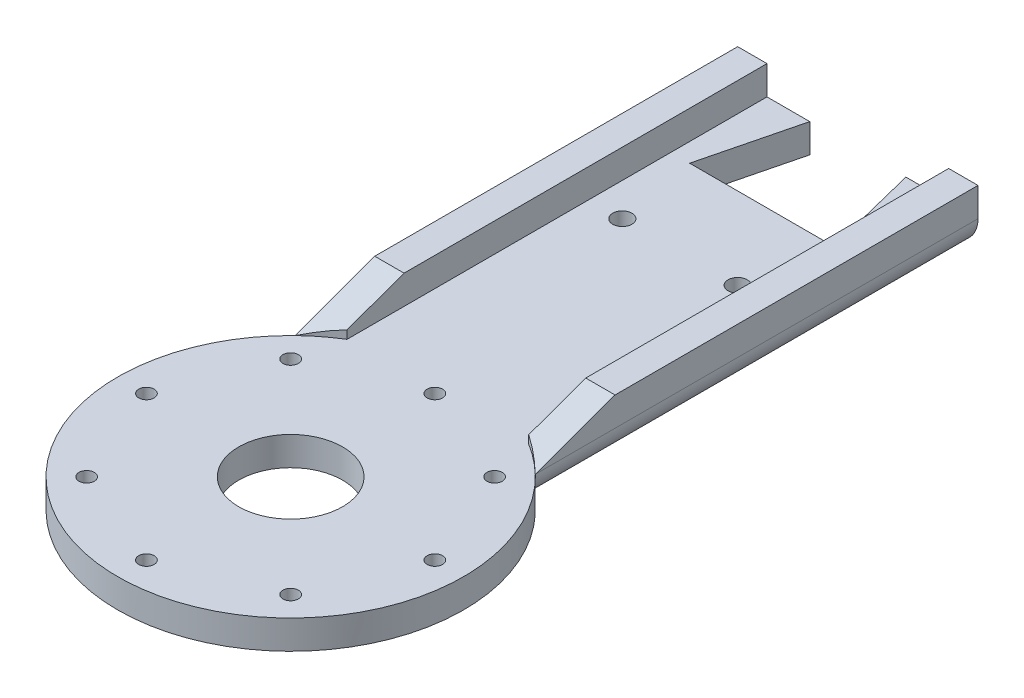
ISO-10303-21;
HEADER;
FILE_DESCRIPTION(('STEP AP214'),'2;1');
FILE_NAME('part.step','',(''),(''),'','','');
FILE_SCHEMA(('AUTOMOTIVE_DESIGN { 1 0 10303 214 1 1 1 1 }'));
ENDSEC;
DATA;
#1=APPLICATION_CONTEXT('core data for automotive mechanical design processes');
#2=APPLICATION_PROTOCOL_DEFINITION('international standard','automotive_design',2000,#1);
#3=PRODUCT_CONTEXT('',#1,'mechanical');
#4=PRODUCT('Part','Part','',(#3));
#5=PRODUCT_RELATED_PRODUCT_CATEGORY('part','',(#4));
#6=PRODUCT_DEFINITION_FORMATION('','',#4);
#7=PRODUCT_DEFINITION_CONTEXT('part definition',#1,'design');
#8=PRODUCT_DEFINITION('design','',#6,#7);
#9=PRODUCT_DEFINITION_SHAPE('','',#8);
#10=(LENGTH_UNIT() NAMED_UNIT(*) SI_UNIT(.MILLI.,.METRE.));
#11=(NAMED_UNIT(*) PLANE_ANGLE_UNIT() SI_UNIT($,.RADIAN.));
#12=(NAMED_UNIT(*) SI_UNIT($,.STERADIAN.) SOLID_ANGLE_UNIT());
#13=UNCERTAINTY_MEASURE_WITH_UNIT(LENGTH_MEASURE(1.E-05),#10,'distance_accuracy_value','');
#14=(GEOMETRIC_REPRESENTATION_CONTEXT(3) GLOBAL_UNCERTAINTY_ASSIGNED_CONTEXT((#13)) GLOBAL_UNIT_ASSIGNED_CONTEXT((#10,
#11,#12)) REPRESENTATION_CONTEXT('',''));
#15=CARTESIAN_POINT('',(0.,0.,0.));
#16=DIRECTION('',(0.,0.,1.));
#17=DIRECTION('',(1.,0.,0.));
#18=AXIS2_PLACEMENT_3D('',#15,#16,#17);
#19=CARTESIAN_POINT('',(0.226911438610488,3.,20.1632131954188));
#20=DIRECTION('',(0.,1.,0.));
#21=DIRECTION('',(0.,0.,1.));
#22=AXIS2_PLACEMENT_3D('',#19,#20,#21);
#23=PLANE('',#22);
#24=CARTESIAN_POINT('',(0.226911123610835,3.,20.1596174357801));
#25=DIRECTION('',(0.,-1.,0.));
#26=DIRECTION('',(0.,0.,1.));
#27=AXIS2_PLACEMENT_3D('',#24,#25,#26);
#28=CIRCLE('',#27,17.993847882213);
#29=CARTESIAN_POINT('',(-12.2730885613881,3.,7.21633464186544));
#30=VERTEX_POINT('',#29);
#31=CARTESIAN_POINT('',(-9.22308856138809,3.,4.84700604641411));
#32=VERTEX_POINT('',#31);
#33=EDGE_CURVE('E187',#30,#32,#28,.T.);
#34=ORIENTED_EDGE('',*,*,#33,.F.);
#35=CARTESIAN_POINT('',(0.226911438610488,3.,20.1632131954188));
#36=DIRECTION('',(0.,1.,0.));
#37=DIRECTION('',(0.,0.,1.));
#38=AXIS2_PLACEMENT_3D('',#35,#36,#37);
#39=CIRCLE('',#38,17.9964347658203);
#40=CARTESIAN_POINT('',(12.7269108086098,3.,7.21633464186544));
#41=VERTEX_POINT('',#40);
#42=EDGE_CURVE('E293',#30,#41,#39,.T.);
#43=ORIENTED_EDGE('',*,*,#42,.T.);
#44=CARTESIAN_POINT('',(0.226911123610835,3.,20.1596174357801));
#45=DIRECTION('',(0.,-1.,0.));
#46=DIRECTION('',(0.,0.,1.));
#47=AXIS2_PLACEMENT_3D('',#44,#45,#46);
#48=CIRCLE('',#47,17.993847882213);
#49=CARTESIAN_POINT('',(9.67691080860975,3.,4.8470060464141));
#50=VERTEX_POINT('',#49);
#51=EDGE_CURVE('E442',#50,#41,#48,.T.);
#52=ORIENTED_EDGE('',*,*,#51,.F.);
#53=DIRECTION('',(0.,0.,1.));
#54=VECTOR('',#53,1.);
#55=CARTESIAN_POINT('',(9.67691080860975,3.,-38.8403822770759));
#56=LINE('',#55,#54);
#57=CARTESIAN_POINT('',(9.67691080860975,3.,-38.8403822770759));
#58=VERTEX_POINT('',#57);
#59=EDGE_CURVE('E452',#58,#50,#56,.T.);
#60=ORIENTED_EDGE('',*,*,#59,.F.);
#61=DIRECTION('',(-1.,0.,0.));
#62=VECTOR('',#61,1.);
#63=CARTESIAN_POINT('',(5.22691143861272,3.,-38.8403822770759));
#64=LINE('',#63,#62);
#65=CARTESIAN_POINT('',(5.22691143861272,3.,-38.8403822770759));
#66=VERTEX_POINT('',#65);
#67=EDGE_CURVE('E297',#58,#66,#64,.T.);
#68=ORIENTED_EDGE('',*,*,#67,.T.);
#69=DIRECTION('',(0.242535625036222,0.,0.97014250014536));
#70=VECTOR('',#69,1.);
#71=CARTESIAN_POINT('',(7.72691143861151,3.,-28.8403822770759));
#72=LINE('',#71,#70);
#73=CARTESIAN_POINT('',(7.72691143861151,3.,-28.8403822770759));
#74=VERTEX_POINT('',#73);
#75=EDGE_CURVE('E301',#66,#74,#72,.T.);
#76=ORIENTED_EDGE('',*,*,#75,.T.);
#77=DIRECTION('',(-1.,0.,0.));
#78=VECTOR('',#77,1.);
#79=CARTESIAN_POINT('',(-7.27308856138728,3.,-28.8403822770759));
#80=LINE('',#79,#78);
#81=CARTESIAN_POINT('',(-7.27308856138728,3.,-28.8403822770759));
#82=VERTEX_POINT('',#81);
#83=EDGE_CURVE('E304',#74,#82,#80,.T.);
#84=ORIENTED_EDGE('',*,*,#83,.T.);
#85=DIRECTION('',(0.242535625036222,0.,-0.97014250014536));
#86=VECTOR('',#85,1.);
#87=CARTESIAN_POINT('',(-4.77308856138849,3.,-38.8403822770759));
#88=LINE('',#87,#86);
#89=CARTESIAN_POINT('',(-4.77308856138849,3.,-38.8403822770759));
#90=VERTEX_POINT('',#89);
#91=EDGE_CURVE('E307',#82,#90,#88,.T.);
#92=ORIENTED_EDGE('',*,*,#91,.T.);
#93=DIRECTION('',(-1.,0.,0.));
#94=VECTOR('',#93,1.);
#95=CARTESIAN_POINT('',(-12.2730885613881,3.,-38.8403822770759));
#96=LINE('',#95,#94);
#97=CARTESIAN_POINT('',(-9.22308856138809,3.,-38.8403822770759));
#98=VERTEX_POINT('',#97);
#99=EDGE_CURVE('E310',#90,#98,#96,.T.);
#100=ORIENTED_EDGE('',*,*,#99,.T.);
#101=DIRECTION('',(0.,0.,-1.));
#102=VECTOR('',#101,1.);
#103=CARTESIAN_POINT('',(-9.22308856138809,3.,-38.8403822770759));
#104=LINE('',#103,#102);
#105=EDGE_CURVE('E181',#32,#98,#104,.T.);
#106=ORIENTED_EDGE('',*,*,#105,.F.);
#107=EDGE_LOOP('',(#34,#43,#52,#60,#68,#76,#84,#92,#100,#106));
#108=FACE_BOUND('',#107,.T.);
#109=CARTESIAN_POINT('',(-5.77308837033677,3.,-20.3403823597509));
#110=DIRECTION('',(0.,1.,0.));
#111=DIRECTION('',(0.,0.,1.));
#112=AXIS2_PLACEMENT_3D('',#109,#110,#111);
#113=CIRCLE('',#112,1.00000002430657);
#114=CARTESIAN_POINT('',(-5.77308837033677,3.,-19.3403823354443));
#115=VERTEX_POINT('',#114);
#116=EDGE_CURVE('E270',#115,#115,#113,.T.);
#117=ORIENTED_EDGE('',*,*,#116,.F.);
#118=EDGE_LOOP('',(#117));
#119=FACE_BOUND('',#118,.T.);
#120=CARTESIAN_POINT('',(6.2269114386117,3.,-20.3403822770759));
#121=DIRECTION('',(0.,1.,0.));
#122=DIRECTION('',(0.,0.,1.));
#123=AXIS2_PLACEMENT_3D('',#120,#121,#122);
#124=CIRCLE('',#123,0.999999877106538);
#125=CARTESIAN_POINT('',(6.2269114386117,3.,-19.3403823999694));
#126=VERTEX_POINT('',#125);
#127=EDGE_CURVE('E278',#126,#126,#124,.T.);
#128=ORIENTED_EDGE('',*,*,#127,.F.);
#129=EDGE_LOOP('',(#128));
#130=FACE_BOUND('',#129,.T.);
#131=CARTESIAN_POINT('',(0.226911438611895,3.,5.15961765623719));
#132=DIRECTION('',(0.,1.,0.));
#133=DIRECTION('',(0.,0.,1.));
#134=AXIS2_PLACEMENT_3D('',#131,#132,#133);
#135=CIRCLE('',#134,0.800000202769333);
#136=CARTESIAN_POINT('',(0.226911438611895,3.,5.95961785900653));
#137=VERTEX_POINT('',#136);
#138=EDGE_CURVE('E262',#137,#137,#135,.T.);
#139=ORIENTED_EDGE('',*,*,#138,.F.);
#140=EDGE_LOOP('',(#139));
#141=FACE_BOUND('',#140,.T.);
#142=CARTESIAN_POINT('',(-14.7766841005684,3.,20.1632131954201));
#143=DIRECTION('',(0.,1.,0.));
#144=DIRECTION('',(0.,0.,1.));
#145=AXIS2_PLACEMENT_3D('',#142,#143,#144);
#146=CIRCLE('',#145,0.800000202769333);
#147=CARTESIAN_POINT('',(-14.7766841005684,3.,20.9632133981894));
#148=VERTEX_POINT('',#147);
#149=EDGE_CURVE('E214',#148,#148,#146,.T.);
#150=ORIENTED_EDGE('',*,*,#149,.F.);
#151=EDGE_LOOP('',(#150));
#152=FACE_BOUND('',#151,.T.);
#153=CARTESIAN_POINT('',(0.226911438614583,3.,35.1668087346005));
#154=DIRECTION('',(0.,1.,0.));
#155=DIRECTION('',(0.,0.,1.));
#156=AXIS2_PLACEMENT_3D('',#153,#154,#155);
#157=CIRCLE('',#156,0.800000202769338);
#158=CARTESIAN_POINT('',(0.226911438614583,3.,35.9668089373698));
#159=VERTEX_POINT('',#158);
#160=EDGE_CURVE('E230',#159,#159,#157,.T.);
#161=ORIENTED_EDGE('',*,*,#160,.F.);
#162=EDGE_LOOP('',(#161));
#163=FACE_BOUND('',#162,.T.);
#164=CARTESIAN_POINT('',(15.2305069777949,3.,20.1632131954175));
#165=DIRECTION('',(0.,1.,0.));
#166=DIRECTION('',(0.,0.,1.));
#167=AXIS2_PLACEMENT_3D('',#164,#165,#166);
#168=CIRCLE('',#167,0.800000202769333);
#169=CARTESIAN_POINT('',(15.2305069777949,3.,20.9632133981868));
#170=VERTEX_POINT('',#169);
#171=EDGE_CURVE('E246',#170,#170,#168,.T.);
#172=ORIENTED_EDGE('',*,*,#171,.F.);
#173=EDGE_LOOP('',(#172));
#174=FACE_BOUND('',#173,.T.);
#175=CARTESIAN_POINT('',(0.226911123610835,3.,20.1596174357801));
#176=DIRECTION('',(0.,1.,0.));
#177=DIRECTION('',(0.,0.,1.));
#178=AXIS2_PLACEMENT_3D('',#175,#176,#177);
#179=CIRCLE('',#178,5.40000008825084);
#180=CARTESIAN_POINT('',(0.226911123610835,3.,25.5596175240309));
#181=VERTEX_POINT('',#180);
#182=EDGE_CURVE('E286',#181,#181,#179,.T.);
#183=ORIENTED_EDGE('',*,*,#182,.F.);
#184=EDGE_LOOP('',(#183));
#185=FACE_BOUND('',#184,.T.);
#186=CARTESIAN_POINT('',(10.8360555865479,3.,9.55406904748229));
#187=DIRECTION('',(0.,1.,0.));
#188=DIRECTION('',(0.,0.,1.));
#189=AXIS2_PLACEMENT_3D('',#186,#187,#188);
#190=CIRCLE('',#189,0.80000020276933);
#191=CARTESIAN_POINT('',(10.8360555865479,3.,10.3540692502516));
#192=VERTEX_POINT('',#191);
#193=EDGE_CURVE('E254',#192,#192,#190,.T.);
#194=ORIENTED_EDGE('',*,*,#193,.F.);
#195=EDGE_LOOP('',(#194));
#196=FACE_BOUND('',#195,.T.);
#197=CARTESIAN_POINT('',(10.8360555865498,3.,30.7723573433535));
#198=DIRECTION('',(0.,1.,0.));
#199=DIRECTION('',(0.,0.,1.));
#200=AXIS2_PLACEMENT_3D('',#197,#198,#199);
#201=CIRCLE('',#200,0.800000202769333);
#202=CARTESIAN_POINT('',(10.8360555865498,3.,31.5723575461228));
#203=VERTEX_POINT('',#202);
#204=EDGE_CURVE('E238',#203,#203,#201,.T.);
#205=ORIENTED_EDGE('',*,*,#204,.F.);
#206=EDGE_LOOP('',(#205));
#207=FACE_BOUND('',#206,.T.);
#208=CARTESIAN_POINT('',(-10.3822327093214,3.,30.7723573433553));
#209=DIRECTION('',(0.,1.,0.));
#210=DIRECTION('',(0.,0.,1.));
#211=AXIS2_PLACEMENT_3D('',#208,#209,#210);
#212=CIRCLE('',#211,0.800000202769334);
#213=CARTESIAN_POINT('',(-10.3822327093214,3.,31.5723575461246));
#214=VERTEX_POINT('',#213);
#215=EDGE_CURVE('E222',#214,#214,#212,.T.);
#216=ORIENTED_EDGE('',*,*,#215,.F.);
#217=EDGE_LOOP('',(#216));
#218=FACE_BOUND('',#217,.T.);
#219=CARTESIAN_POINT('',(-10.3822327093231,3.,9.55406904748412));
#220=DIRECTION('',(0.,1.,0.));
#221=DIRECTION('',(0.,0.,1.));
#222=AXIS2_PLACEMENT_3D('',#219,#220,#221);
#223=CIRCLE('',#222,0.800000202769332);
#224=CARTESIAN_POINT('',(-10.3822327093231,3.,10.3540692502534));
#225=VERTEX_POINT('',#224);
#226=EDGE_CURVE('E206',#225,#225,#223,.T.);
#227=ORIENTED_EDGE('',*,*,#226,.F.);
#228=EDGE_LOOP('',(#227));
#229=FACE_BOUND('',#228,.T.);
#230=ADVANCED_FACE('F39',(#108,#119,#130,#141,#152,#163,#174,#185,#196,#207,#218,#229),#23,.T.);
#231=CARTESIAN_POINT('',(0.226911438610488,0.,20.1632131954188));
#232=DIRECTION('',(0.,1.,0.));
#233=DIRECTION('',(0.,0.,1.));
#234=AXIS2_PLACEMENT_3D('',#231,#232,#233);
#235=PLANE('',#234);
#236=DIRECTION('',(-1.,0.,0.));
#237=VECTOR('',#236,1.);
#238=CARTESIAN_POINT('',(5.22691143861272,0.,-38.8403822770759));
#239=LINE('',#238,#237);
#240=CARTESIAN_POINT('',(9.72691143860918,0.,-38.8403822770759));
#241=VERTEX_POINT('',#240);
#242=CARTESIAN_POINT('',(5.22691143861272,0.,-38.8403822770759));
#243=VERTEX_POINT('',#242);
#244=EDGE_CURVE('E316',#241,#243,#239,.T.);
#245=ORIENTED_EDGE('',*,*,#244,.F.);
#246=DIRECTION('',(0.,0.,-1.));
#247=VECTOR('',#246,1.);
#248=CARTESIAN_POINT('',(9.72691143860919,0.,20.1632131954188));
#249=LINE('',#248,#247);
#250=CARTESIAN_POINT('',(9.72691143860919,0.,4.87852594704997));
#251=VERTEX_POINT('',#250);
#252=EDGE_CURVE('E365',#241,#251,#249,.F.);
#253=ORIENTED_EDGE('',*,*,#252,.T.);
#254=CARTESIAN_POINT('',(0.226911438610488,0.,20.1632131954188));
#255=DIRECTION('',(0.,1.,0.));
#256=DIRECTION('',(0.,0.,1.));
#257=AXIS2_PLACEMENT_3D('',#254,#255,#256);
#258=CIRCLE('',#257,17.9964347658203);
#259=CARTESIAN_POINT('',(-9.27308856138809,0.,4.87852594704989));
#260=VERTEX_POINT('',#259);
#261=EDGE_CURVE('E68',#260,#251,#258,.T.);
#262=ORIENTED_EDGE('',*,*,#261,.F.);
#263=DIRECTION('',(0.,0.,1.));
#264=VECTOR('',#263,1.);
#265=CARTESIAN_POINT('',(-9.27308856138809,0.,20.1632131954188));
#266=LINE('',#265,#264);
#267=CARTESIAN_POINT('',(-9.27308856138809,0.,-38.8403822770759));
#268=VERTEX_POINT('',#267);
#269=EDGE_CURVE('E362',#260,#268,#266,.F.);
#270=ORIENTED_EDGE('',*,*,#269,.T.);
#271=DIRECTION('',(-1.,0.,0.));
#272=VECTOR('',#271,1.);
#273=CARTESIAN_POINT('',(-12.2730885613881,0.,-38.8403822770759));
#274=LINE('',#273,#272);
#275=CARTESIAN_POINT('',(-4.77308856138849,0.,-38.8403822770759));
#276=VERTEX_POINT('',#275);
#277=EDGE_CURVE('E298',#276,#268,#274,.T.);
#278=ORIENTED_EDGE('',*,*,#277,.F.);
#279=DIRECTION('',(0.242535625036222,0.,-0.97014250014536));
#280=VECTOR('',#279,1.);
#281=CARTESIAN_POINT('',(-4.77308856138849,0.,-38.8403822770759));
#282=LINE('',#281,#280);
#283=CARTESIAN_POINT('',(-7.27308856138728,0.,-28.8403822770759));
#284=VERTEX_POINT('',#283);
#285=EDGE_CURVE('E325',#284,#276,#282,.T.);
#286=ORIENTED_EDGE('',*,*,#285,.F.);
#287=DIRECTION('',(-1.,0.,0.));
#288=VECTOR('',#287,1.);
#289=CARTESIAN_POINT('',(-7.27308856138728,0.,-28.8403822770759));
#290=LINE('',#289,#288);
#291=CARTESIAN_POINT('',(7.72691143861151,0.,-28.8403822770759));
#292=VERTEX_POINT('',#291);
#293=EDGE_CURVE('E322',#292,#284,#290,.T.);
#294=ORIENTED_EDGE('',*,*,#293,.F.);
#295=DIRECTION('',(0.242535625036222,0.,0.97014250014536));
#296=VECTOR('',#295,1.);
#297=CARTESIAN_POINT('',(7.72691143861151,0.,-28.8403822770759));
#298=LINE('',#297,#296);
#299=EDGE_CURVE('E319',#243,#292,#298,.T.);
#300=ORIENTED_EDGE('',*,*,#299,.F.);
#301=EDGE_LOOP('',(#245,#253,#262,#270,#278,#286,#294,#300));
#302=FACE_BOUND('',#301,.T.);
#303=CARTESIAN_POINT('',(0.226911123610835,0.,20.1596174357801));
#304=DIRECTION('',(0.,1.,0.));
#305=DIRECTION('',(0.,0.,1.));
#306=AXIS2_PLACEMENT_3D('',#303,#304,#305);
#307=CIRCLE('',#306,5.40000008825084);
#308=CARTESIAN_POINT('',(0.226911123610835,0.,25.5596175240309));
#309=VERTEX_POINT('',#308);
#310=EDGE_CURVE('E282',#309,#309,#307,.T.);
#311=ORIENTED_EDGE('',*,*,#310,.T.);
#312=EDGE_LOOP('',(#311));
#313=FACE_BOUND('',#312,.T.);
#314=CARTESIAN_POINT('',(6.2269114386117,0.,-20.3403822770759));
#315=DIRECTION('',(0.,1.,0.));
#316=DIRECTION('',(0.,0.,1.));
#317=AXIS2_PLACEMENT_3D('',#314,#315,#316);
#318=CIRCLE('',#317,0.999999877106538);
#319=CARTESIAN_POINT('',(6.2269114386117,0.,-19.3403823999694));
#320=VERTEX_POINT('',#319);
#321=EDGE_CURVE('E274',#320,#320,#318,.T.);
#322=ORIENTED_EDGE('',*,*,#321,.T.);
#323=EDGE_LOOP('',(#322));
#324=FACE_BOUND('',#323,.T.);
#325=CARTESIAN_POINT('',(-5.77308837033677,0.,-20.3403823597509));
#326=DIRECTION('',(0.,1.,0.));
#327=DIRECTION('',(0.,0.,1.));
#328=AXIS2_PLACEMENT_3D('',#325,#326,#327);
#329=CIRCLE('',#328,1.00000002430657);
#330=CARTESIAN_POINT('',(-5.77308837033677,0.,-19.3403823354443));
#331=VERTEX_POINT('',#330);
#332=EDGE_CURVE('E266',#331,#331,#329,.T.);
#333=ORIENTED_EDGE('',*,*,#332,.T.);
#334=EDGE_LOOP('',(#333));
#335=FACE_BOUND('',#334,.T.);
#336=CARTESIAN_POINT('',(0.226911438611895,0.,5.15961765623719));
#337=DIRECTION('',(0.,1.,0.));
#338=DIRECTION('',(0.,0.,1.));
#339=AXIS2_PLACEMENT_3D('',#336,#337,#338);
#340=CIRCLE('',#339,0.800000202769333);
#341=CARTESIAN_POINT('',(0.226911438611895,0.,5.95961785900653));
#342=VERTEX_POINT('',#341);
#343=EDGE_CURVE('E258',#342,#342,#340,.T.);
#344=ORIENTED_EDGE('',*,*,#343,.T.);
#345=EDGE_LOOP('',(#344));
#346=FACE_BOUND('',#345,.T.);
#347=CARTESIAN_POINT('',(10.8360555865479,0.,9.55406904748229));
#348=DIRECTION('',(0.,1.,0.));
#349=DIRECTION('',(0.,0.,1.));
#350=AXIS2_PLACEMENT_3D('',#347,#348,#349);
#351=CIRCLE('',#350,0.80000020276933);
#352=CARTESIAN_POINT('',(10.8360555865479,0.,10.3540692502516));
#353=VERTEX_POINT('',#352);
#354=EDGE_CURVE('E250',#353,#353,#351,.T.);
#355=ORIENTED_EDGE('',*,*,#354,.T.);
#356=EDGE_LOOP('',(#355));
#357=FACE_BOUND('',#356,.T.);
#358=CARTESIAN_POINT('',(15.2305069777949,0.,20.1632131954175));
#359=DIRECTION('',(0.,1.,0.));
#360=DIRECTION('',(0.,0.,1.));
#361=AXIS2_PLACEMENT_3D('',#358,#359,#360);
#362=CIRCLE('',#361,0.800000202769333);
#363=CARTESIAN_POINT('',(15.2305069777949,0.,20.9632133981868));
#364=VERTEX_POINT('',#363);
#365=EDGE_CURVE('E242',#364,#364,#362,.T.);
#366=ORIENTED_EDGE('',*,*,#365,.T.);
#367=EDGE_LOOP('',(#366));
#368=FACE_BOUND('',#367,.T.);
#369=CARTESIAN_POINT('',(10.8360555865498,0.,30.7723573433535));
#370=DIRECTION('',(0.,1.,0.));
#371=DIRECTION('',(0.,0.,1.));
#372=AXIS2_PLACEMENT_3D('',#369,#370,#371);
#373=CIRCLE('',#372,0.800000202769333);
#374=CARTESIAN_POINT('',(10.8360555865498,0.,31.5723575461228));
#375=VERTEX_POINT('',#374);
#376=EDGE_CURVE('E234',#375,#375,#373,.T.);
#377=ORIENTED_EDGE('',*,*,#376,.T.);
#378=EDGE_LOOP('',(#377));
#379=FACE_BOUND('',#378,.T.);
#380=CARTESIAN_POINT('',(0.226911438614583,0.,35.1668087346005));
#381=DIRECTION('',(0.,1.,0.));
#382=DIRECTION('',(0.,0.,1.));
#383=AXIS2_PLACEMENT_3D('',#380,#381,#382);
#384=CIRCLE('',#383,0.800000202769338);
#385=CARTESIAN_POINT('',(0.226911438614583,0.,35.9668089373698));
#386=VERTEX_POINT('',#385);
#387=EDGE_CURVE('E226',#386,#386,#384,.T.);
#388=ORIENTED_EDGE('',*,*,#387,.T.);
#389=EDGE_LOOP('',(#388));
#390=FACE_BOUND('',#389,.T.);
#391=CARTESIAN_POINT('',(-10.3822327093214,0.,30.7723573433553));
#392=DIRECTION('',(0.,1.,0.));
#393=DIRECTION('',(0.,0.,1.));
#394=AXIS2_PLACEMENT_3D('',#391,#392,#393);
#395=CIRCLE('',#394,0.800000202769334);
#396=CARTESIAN_POINT('',(-10.3822327093214,0.,31.5723575461246));
#397=VERTEX_POINT('',#396);
#398=EDGE_CURVE('E218',#397,#397,#395,.T.);
#399=ORIENTED_EDGE('',*,*,#398,.T.);
#400=EDGE_LOOP('',(#399));
#401=FACE_BOUND('',#400,.T.);
#402=CARTESIAN_POINT('',(-14.7766841005684,0.,20.1632131954201));
#403=DIRECTION('',(0.,1.,0.));
#404=DIRECTION('',(0.,0.,1.));
#405=AXIS2_PLACEMENT_3D('',#402,#403,#404);
#406=CIRCLE('',#405,0.800000202769333);
#407=CARTESIAN_POINT('',(-14.7766841005684,0.,20.9632133981894));
#408=VERTEX_POINT('',#407);
#409=EDGE_CURVE('E210',#408,#408,#406,.T.);
#410=ORIENTED_EDGE('',*,*,#409,.T.);
#411=EDGE_LOOP('',(#410));
#412=FACE_BOUND('',#411,.T.);
#413=CARTESIAN_POINT('',(-10.3822327093231,0.,9.55406904748412));
#414=DIRECTION('',(0.,1.,0.));
#415=DIRECTION('',(0.,0.,1.));
#416=AXIS2_PLACEMENT_3D('',#413,#414,#415);
#417=CIRCLE('',#416,0.800000202769332);
#418=CARTESIAN_POINT('',(-10.3822327093231,0.,10.3540692502534));
#419=VERTEX_POINT('',#418);
#420=EDGE_CURVE('E205',#419,#419,#417,.T.);
#421=ORIENTED_EDGE('',*,*,#420,.T.);
#422=EDGE_LOOP('',(#421));
#423=FACE_BOUND('',#422,.T.);
#424=ADVANCED_FACE('F385',(#302,#313,#324,#335,#346,#357,#368,#379,#390,#401,#412,#423),#235,.F.);
#425=CARTESIAN_POINT('',(-12.2730885613881,3.,-38.8403822770759));
#426=DIRECTION('',(1.,0.,0.));
#427=DIRECTION('',(0.,0.,-1.));
#428=AXIS2_PLACEMENT_3D('',#425,#426,#427);
#429=PLANE('',#428);
#430=DIRECTION('',(0.,-1.,0.));
#431=VECTOR('',#430,1.);
#432=CARTESIAN_POINT('',(-12.2730885613881,3.,-38.8403822770759));
#433=LINE('',#432,#431);
#434=CARTESIAN_POINT('',(-12.2730885613881,6.,-38.8403822770759));
#435=VERTEX_POINT('',#434);
#436=CARTESIAN_POINT('',(-12.2730885613881,3.,-38.8403822770759));
#437=VERTEX_POINT('',#436);
#438=EDGE_CURVE('E313',#435,#437,#433,.T.);
#439=ORIENTED_EDGE('',*,*,#438,.T.);
#440=DIRECTION('',(0.,0.,1.));
#441=VECTOR('',#440,1.);
#442=CARTESIAN_POINT('',(-12.2730885613881,3.,-38.8403822770759));
#443=LINE('',#442,#441);
#444=EDGE_CURVE('E172',#437,#30,#443,.T.);
#445=ORIENTED_EDGE('',*,*,#444,.T.);
#446=DIRECTION('',(0.,-0.339922884021923,0.940453312460655));
#447=VECTOR('',#446,1.);
#448=CARTESIAN_POINT('',(-12.2730885613881,6.,-1.08366535813456));
#449=LINE('',#448,#447);
#450=CARTESIAN_POINT('',(-12.2730885613881,6.,-1.08366535813456));
#451=VERTEX_POINT('',#450);
#452=EDGE_CURVE('E156',#451,#30,#449,.T.);
#453=ORIENTED_EDGE('',*,*,#452,.F.);
#454=DIRECTION('',(0.,0.,1.));
#455=VECTOR('',#454,1.);
#456=CARTESIAN_POINT('',(-12.2730885613881,6.,-38.8403822770759));
#457=LINE('',#456,#455);
#458=EDGE_CURVE('E170',#435,#451,#457,.T.);
#459=ORIENTED_EDGE('',*,*,#458,.F.);
#460=EDGE_LOOP('',(#439,#445,#453,#459));
#461=FACE_BOUND('',#460,.T.);
#462=ADVANCED_FACE('F169',(#461),#429,.F.);
#463=CARTESIAN_POINT('',(0.226911438610488,3.,20.1632131954188));
#464=DIRECTION('',(0.,-1.,0.));
#465=DIRECTION('',(0.,0.,-1.));
#466=AXIS2_PLACEMENT_3D('',#463,#464,#465);
#467=CYLINDRICAL_SURFACE('',#466,17.9964347658203);
#468=ORIENTED_EDGE('',*,*,#261,.T.);
#469=CARTESIAN_POINT('',(9.72691143860919,0.,4.87852594704997));
#470=CARTESIAN_POINT('',(9.83532383917242,7.70221850073455E-06,4.94589163160942));
#471=CARTESIAN_POINT('',(9.94296979444799,0.00587569812078064,5.01441259473732));
#472=CARTESIAN_POINT('',(10.1559088019641,0.0288998195278394,5.15312716215045));
#473=CARTESIAN_POINT('',(10.2612025984383,0.0460523207221583,5.22332022242452));
#474=CARTESIAN_POINT('',(10.4690035908862,0.091282267048737,5.36500035745982));
#475=CARTESIAN_POINT('',(10.5715013318128,0.119392799273115,5.43649072003552));
#476=CARTESIAN_POINT('',(10.7726707022109,0.186173070125989,5.57986966557676));
#477=CARTESIAN_POINT('',(10.8713421917868,0.224843194420327,5.65175826299298));
#478=CARTESIAN_POINT('',(11.1489038050057,0.350939908094247,5.85823215865373));
#479=CARTESIAN_POINT('',(11.3222899006691,0.451390858007221,5.9925349828238));
#480=CARTESIAN_POINT('',(11.6487245662191,0.687604782369547,6.25431270271033));
#481=CARTESIAN_POINT('',(11.8018045901168,0.823312156681161,6.38179797152536));
#482=CARTESIAN_POINT('',(12.0424943486716,1.08680372448396,6.58818674170604));
#483=CARTESIAN_POINT('',(12.1363991324814,1.20604990116792,6.67065883100823));
#484=CARTESIAN_POINT('',(12.3076769697389,1.46267812241918,6.82380140761));
#485=CARTESIAN_POINT('',(12.3850748465863,1.60003242500841,6.89448958032417));
#486=CARTESIAN_POINT('',(12.5054923182628,1.86168251178784,7.00595502091786));
#487=CARTESIAN_POINT('',(12.552307351527,1.98287414749725,7.04989354035619));
#488=CARTESIAN_POINT('',(12.6304560039853,2.23408311900182,7.12378615275434));
#489=CARTESIAN_POINT('',(12.6618258979325,2.36407895155186,7.15377300366013));
#490=CARTESIAN_POINT('',(12.6984203475744,2.5791481220453,7.18887259491786));
#491=CARTESIAN_POINT('',(12.7090507518218,2.66251046220366,7.19910778732025));
#492=CARTESIAN_POINT('',(12.7233186764939,2.83055626028297,7.21286570516418));
#493=CARTESIAN_POINT('',(12.7269410582999,2.91524218075166,7.21637389890576));
#494=CARTESIAN_POINT('',(12.7269114386092,3.,7.21633464186557));
#495=B_SPLINE_CURVE_WITH_KNOTS('',3,(#469,#470,#471,#472,#473,#474,#475,#476,#477,#478,#479,
#480,#481,#482,#483,#484,#485,#486,#487,#488,#489,#490,#491,#492,#493,#494),.UNSPECIFIED.,.F.,
.F.,(4,2,2,2,2,2,2,2,2,2,2,2,4),(0.,0.382710447070086,0.765298036758656,1.14904988705858,
1.53281575492461,2.25299818959785,2.97205170342164,3.48853805287306,4.00424213655958,
4.41412167833777,4.82303392166929,5.07648252673355,5.33047801879585),.UNSPECIFIED.);
#496=EDGE_CURVE('E54',#251,#41,#495,.T.);
#497=ORIENTED_EDGE('',*,*,#496,.T.);
#498=ORIENTED_EDGE('',*,*,#42,.F.);
#499=CARTESIAN_POINT('',(-12.2730885613881,3.,7.21633464186544));
#500=CARTESIAN_POINT('',(-12.2731061602408,2.93075540376491,7.21635682136357));
#501=CARTESIAN_POINT('',(-12.2706918095605,2.86152658959577,7.21402071427191));
#502=CARTESIAN_POINT('',(-12.2611361226338,2.72376333756891,7.20480233731879));
#503=CARTESIAN_POINT('',(-12.2539991840498,2.65522831387969,7.19792429690678));
#504=CARTESIAN_POINT('',(-12.235222854675,2.52001874615603,7.17987654924136));
#505=CARTESIAN_POINT('',(-12.2236261328917,2.45333280474815,7.16874751997701));
#506=CARTESIAN_POINT('',(-12.1961658454706,2.32165759093721,7.14249213015941));
#507=CARTESIAN_POINT('',(-12.1803015089267,2.25666862740713,7.12736504740247));
#508=CARTESIAN_POINT('',(-12.1268356573208,2.06534537248049,7.07661669107271));
#509=CARTESIAN_POINT('',(-12.0832738324657,1.94205042340578,7.03554283925489));
#510=CARTESIAN_POINT('',(-11.9825735570699,1.70566545159301,6.94183371824722));
#511=CARTESIAN_POINT('',(-11.9253981080556,1.59260441844688,6.8891669724192));
#512=CARTESIAN_POINT('',(-11.7728052566779,1.33177407948292,6.75079195706028));
#513=CARTESIAN_POINT('',(-11.6714890760277,1.18983242702024,6.66058416065979));
#514=CARTESIAN_POINT('',(-11.4507320557653,0.929468995030985,6.46920997197785));
#515=CARTESIAN_POINT('',(-11.331265244609,0.811081488654337,6.3680279371035));
#516=CARTESIAN_POINT('',(-11.0750612542071,0.595525590415507,6.15731501434884));
#517=CARTESIAN_POINT('',(-10.9380107281868,0.498862206286856,6.04765230438127));
#518=CARTESIAN_POINT('',(-10.6515505033855,0.330275853662149,5.8257272511155));
#519=CARTESIAN_POINT('',(-10.5021495412495,0.258335578817802,5.71346678525915));
#520=CARTESIAN_POINT('',(-10.263166776421,0.166632410398366,5.53991205848754));
#521=CARTESIAN_POINT('',(-10.1769992112709,0.13797098375913,5.47846886516619));
#522=CARTESIAN_POINT('',(-10.0020682963556,0.0884972555407829,5.35608590840701));
#523=CARTESIAN_POINT('',(-9.91330500313464,0.0676847831203462,5.29514613403995));
#524=CARTESIAN_POINT('',(-9.73355315456303,0.0341374245599105,5.17413238507985));
#525=CARTESIAN_POINT('',(-9.64256248563684,0.0214105459751476,5.11405932618281));
#526=CARTESIAN_POINT('',(-9.45893029421166,0.00434267955020753,4.99521487070899));
#527=CARTESIAN_POINT('',(-9.36628836629768,3.78055438219545E-06,4.9364438019657));
#528=CARTESIAN_POINT('',(-9.27308856138809,0.,4.87852594704989));
#529=B_SPLINE_CURVE_WITH_KNOTS('',3,(#499,#500,#501,#502,#503,#504,#505,#506,#507,#508,#509,
#510,#511,#512,#513,#514,#515,#516,#517,#518,#519,#520,#521,#522,#523,#524,#525,#526,#527,#528),
.UNSPECIFIED.,.F.,.F.,(4,2,2,2,2,2,2,2,2,2,2,2,2,2,4),(0.,0.207626746449687,0.41506042294929,
0.620556959365418,0.826090641835499,1.2353329879079,1.64570051076167,2.23151888836623,
2.81818354232828,3.4173291707116,4.01605453459768,4.34471982322984,4.67337795767899,
5.00236107289588,5.33142610367274),.UNSPECIFIED.);
#530=EDGE_CURVE('E11',#30,#260,#529,.T.);
#531=ORIENTED_EDGE('',*,*,#530,.T.);
#532=EDGE_LOOP('',(#468,#497,#498,#531));
#533=FACE_BOUND('',#532,.T.);
#534=ADVANCED_FACE('F376',(#533),#467,.T.);
#535=CARTESIAN_POINT('',(12.7269114386092,3.,-38.8403822770759));
#536=DIRECTION('',(-1.,0.,0.));
#537=DIRECTION('',(0.,0.,1.));
#538=AXIS2_PLACEMENT_3D('',#535,#536,#537);
#539=PLANE('',#538);
#540=DIRECTION('',(0.,-0.339922884021923,0.940453312460655));
#541=VECTOR('',#540,1.);
#542=CARTESIAN_POINT('',(12.7269114386092,17.7234850594638,-33.5186406893178));
#543=LINE('',#542,#541);
#544=CARTESIAN_POINT('',(12.7269108086098,6.,-1.08366535813457));
#545=VERTEX_POINT('',#544);
#546=EDGE_CURVE('E428',#545,#41,#543,.T.);
#547=ORIENTED_EDGE('',*,*,#546,.T.);
#548=DIRECTION('',(0.,0.,-1.));
#549=VECTOR('',#548,1.);
#550=CARTESIAN_POINT('',(12.7269114386092,3.,-38.8403822770759));
#551=LINE('',#550,#549);
#552=CARTESIAN_POINT('',(12.7269114386092,3.,-38.8403822770759));
#553=VERTEX_POINT('',#552);
#554=EDGE_CURVE('E355',#41,#553,#551,.T.);
#555=ORIENTED_EDGE('',*,*,#554,.T.);
#556=DIRECTION('',(0.,-1.,0.));
#557=VECTOR('',#556,1.);
#558=CARTESIAN_POINT('',(12.7269114386092,3.,-38.8403822770759));
#559=LINE('',#558,#557);
#560=CARTESIAN_POINT('',(12.7269108086098,6.,-38.8403822770759));
#561=VERTEX_POINT('',#560);
#562=EDGE_CURVE('E348',#561,#553,#559,.T.);
#563=ORIENTED_EDGE('',*,*,#562,.F.);
#564=DIRECTION('',(0.,0.,-1.));
#565=VECTOR('',#564,1.);
#566=CARTESIAN_POINT('',(12.7269108086098,6.,-38.8403822770759));
#567=LINE('',#566,#565);
#568=EDGE_CURVE('E431',#545,#561,#567,.T.);
#569=ORIENTED_EDGE('',*,*,#568,.F.);
#570=EDGE_LOOP('',(#547,#555,#563,#569));
#571=FACE_BOUND('',#570,.T.);
#572=ADVANCED_FACE('F390',(#571),#539,.F.);
#573=CARTESIAN_POINT('',(5.22691143861272,3.,-38.8403822770759));
#574=DIRECTION('',(0.,0.,1.));
#575=DIRECTION('',(1.,0.,0.));
#576=AXIS2_PLACEMENT_3D('',#573,#574,#575);
#577=PLANE('',#576);
#578=ORIENTED_EDGE('',*,*,#562,.T.);
#579=CARTESIAN_POINT('',(9.72691143860919,3.,-38.8403822770759));
#580=DIRECTION('',(0.,0.,1.));
#581=DIRECTION('',(1.,0.,0.));
#582=AXIS2_PLACEMENT_3D('',#579,#580,#581);
#583=CIRCLE('',#582,3.);
#584=EDGE_CURVE('E359',#553,#241,#583,.F.);
#585=ORIENTED_EDGE('',*,*,#584,.T.);
#586=ORIENTED_EDGE('',*,*,#244,.T.);
#587=DIRECTION('',(0.,-1.,0.));
#588=VECTOR('',#587,1.);
#589=CARTESIAN_POINT('',(5.22691143861272,3.,-38.8403822770759));
#590=LINE('',#589,#588);
#591=EDGE_CURVE('E344',#66,#243,#590,.T.);
#592=ORIENTED_EDGE('',*,*,#591,.F.);
#593=ORIENTED_EDGE('',*,*,#67,.F.);
#594=DIRECTION('',(0.,-1.,0.));
#595=VECTOR('',#594,1.);
#596=CARTESIAN_POINT('',(9.67691080860975,6.,-38.8403822770759));
#597=LINE('',#596,#595);
#598=CARTESIAN_POINT('',(9.67691080860975,6.,-38.8403822770759));
#599=VERTEX_POINT('',#598);
#600=EDGE_CURVE('E190',#599,#58,#597,.T.);
#601=ORIENTED_EDGE('',*,*,#600,.F.);
#602=DIRECTION('',(-1.,0.,0.));
#603=VECTOR('',#602,1.);
#604=CARTESIAN_POINT('',(12.7269108086098,6.,-38.8403822770759));
#605=LINE('',#604,#603);
#606=EDGE_CURVE('E451',#561,#599,#605,.T.);
#607=ORIENTED_EDGE('',*,*,#606,.F.);
#608=EDGE_LOOP('',(#578,#585,#586,#592,#593,#601,#607));
#609=FACE_BOUND('',#608,.T.);
#610=ADVANCED_FACE('F418',(#609),#577,.F.);
#611=CARTESIAN_POINT('',(7.72691143861151,3.,-28.8403822770759));
#612=DIRECTION('',(0.97014250014536,0.,-0.242535625036222));
#613=DIRECTION('',(-0.242535625036222,0.,-0.97014250014536));
#614=AXIS2_PLACEMENT_3D('',#611,#612,#613);
#615=PLANE('',#614);
#616=ORIENTED_EDGE('',*,*,#299,.T.);
#617=DIRECTION('',(0.,-1.,0.));
#618=VECTOR('',#617,1.);
#619=CARTESIAN_POINT('',(7.72691143861151,3.,-28.8403822770759));
#620=LINE('',#619,#618);
#621=EDGE_CURVE('E340',#74,#292,#620,.T.);
#622=ORIENTED_EDGE('',*,*,#621,.F.);
#623=ORIENTED_EDGE('',*,*,#75,.F.);
#624=ORIENTED_EDGE('',*,*,#591,.T.);
#625=EDGE_LOOP('',(#616,#622,#623,#624));
#626=FACE_BOUND('',#625,.T.);
#627=ADVANCED_FACE('F414',(#626),#615,.F.);
#628=CARTESIAN_POINT('',(-7.27308856138728,3.,-28.8403822770759));
#629=DIRECTION('',(0.,0.,1.));
#630=DIRECTION('',(1.,0.,0.));
#631=AXIS2_PLACEMENT_3D('',#628,#629,#630);
#632=PLANE('',#631);
#633=ORIENTED_EDGE('',*,*,#293,.T.);
#634=DIRECTION('',(0.,-1.,0.));
#635=VECTOR('',#634,1.);
#636=CARTESIAN_POINT('',(-7.27308856138728,3.,-28.8403822770759));
#637=LINE('',#636,#635);
#638=EDGE_CURVE('E336',#82,#284,#637,.T.);
#639=ORIENTED_EDGE('',*,*,#638,.F.);
#640=ORIENTED_EDGE('',*,*,#83,.F.);
#641=ORIENTED_EDGE('',*,*,#621,.T.);
#642=EDGE_LOOP('',(#633,#639,#640,#641));
#643=FACE_BOUND('',#642,.T.);
#644=ADVANCED_FACE('F410',(#643),#632,.F.);
#645=CARTESIAN_POINT('',(-4.77308856138849,3.,-38.8403822770759));
#646=DIRECTION('',(-0.97014250014536,0.,-0.242535625036222));
#647=DIRECTION('',(-0.242535625036222,0.,0.97014250014536));
#648=AXIS2_PLACEMENT_3D('',#645,#646,#647);
#649=PLANE('',#648);
#650=ORIENTED_EDGE('',*,*,#285,.T.);
#651=DIRECTION('',(0.,-1.,0.));
#652=VECTOR('',#651,1.);
#653=CARTESIAN_POINT('',(-4.77308856138849,3.,-38.8403822770759));
#654=LINE('',#653,#652);
#655=EDGE_CURVE('E332',#90,#276,#654,.T.);
#656=ORIENTED_EDGE('',*,*,#655,.F.);
#657=ORIENTED_EDGE('',*,*,#91,.F.);
#658=ORIENTED_EDGE('',*,*,#638,.T.);
#659=EDGE_LOOP('',(#650,#656,#657,#658));
#660=FACE_BOUND('',#659,.T.);
#661=ADVANCED_FACE('F407',(#660),#649,.F.);
#662=CARTESIAN_POINT('',(-12.2730885613881,3.,-38.8403822770759));
#663=DIRECTION('',(0.,0.,1.));
#664=DIRECTION('',(1.,0.,0.));
#665=AXIS2_PLACEMENT_3D('',#662,#663,#664);
#666=PLANE('',#665);
#667=ORIENTED_EDGE('',*,*,#277,.T.);
#668=CARTESIAN_POINT('',(-9.27308856138809,3.,-38.8403822770759));
#669=DIRECTION('',(0.,0.,1.));
#670=DIRECTION('',(1.,0.,0.));
#671=AXIS2_PLACEMENT_3D('',#668,#669,#670);
#672=CIRCLE('',#671,3.);
#673=EDGE_CURVE('E61',#268,#437,#672,.F.);
#674=ORIENTED_EDGE('',*,*,#673,.T.);
#675=ORIENTED_EDGE('',*,*,#438,.F.);
#676=DIRECTION('',(-1.,0.,0.));
#677=VECTOR('',#676,1.);
#678=CARTESIAN_POINT('',(-12.2730885613881,6.,-38.8403822770759));
#679=LINE('',#678,#677);
#680=CARTESIAN_POINT('',(-9.22308856138809,6.,-38.8403822770759));
#681=VERTEX_POINT('',#680);
#682=EDGE_CURVE('E178',#681,#435,#679,.T.);
#683=ORIENTED_EDGE('',*,*,#682,.F.);
#684=DIRECTION('',(0.,-1.,0.));
#685=VECTOR('',#684,1.);
#686=CARTESIAN_POINT('',(-9.22308856138809,6.,-38.8403822770759));
#687=LINE('',#686,#685);
#688=EDGE_CURVE('E195',#681,#98,#687,.T.);
#689=ORIENTED_EDGE('',*,*,#688,.T.);
#690=ORIENTED_EDGE('',*,*,#99,.F.);
#691=ORIENTED_EDGE('',*,*,#655,.T.);
#692=EDGE_LOOP('',(#667,#674,#675,#683,#689,#690,#691));
#693=FACE_BOUND('',#692,.T.);
#694=ADVANCED_FACE('F404',(#693),#666,.F.);
#695=CARTESIAN_POINT('',(0.226911123610835,3.,20.1596174357801));
#696=DIRECTION('',(0.,-1.,0.));
#697=DIRECTION('',(0.,0.,-1.));
#698=AXIS2_PLACEMENT_3D('',#695,#696,#697);
#699=CYLINDRICAL_SURFACE('',#698,5.40000008825084);
#700=ORIENTED_EDGE('',*,*,#182,.T.);
#701=EDGE_LOOP('',(#700));
#702=FACE_BOUND('',#701,.T.);
#703=ORIENTED_EDGE('',*,*,#310,.F.);
#704=EDGE_LOOP('',(#703));
#705=FACE_BOUND('',#704,.T.);
#706=ADVANCED_FACE('F401',(#702,#705),#699,.F.);
#707=CARTESIAN_POINT('',(6.2269114386117,3.,-20.3403822770759));
#708=DIRECTION('',(0.,-1.,0.));
#709=DIRECTION('',(0.,0.,-1.));
#710=AXIS2_PLACEMENT_3D('',#707,#708,#709);
#711=CYLINDRICAL_SURFACE('',#710,0.999999877106538);
#712=ORIENTED_EDGE('',*,*,#127,.T.);
#713=EDGE_LOOP('',(#712));
#714=FACE_BOUND('',#713,.T.);
#715=ORIENTED_EDGE('',*,*,#321,.F.);
#716=EDGE_LOOP('',(#715));
#717=FACE_BOUND('',#716,.T.);
#718=ADVANCED_FACE('F555',(#714,#717),#711,.F.);
#719=CARTESIAN_POINT('',(-5.77308837033677,3.,-20.3403823597509));
#720=DIRECTION('',(0.,-1.,0.));
#721=DIRECTION('',(0.,0.,-1.));
#722=AXIS2_PLACEMENT_3D('',#719,#720,#721);
#723=CYLINDRICAL_SURFACE('',#722,1.00000002430657);
#724=ORIENTED_EDGE('',*,*,#116,.T.);
#725=EDGE_LOOP('',(#724));
#726=FACE_BOUND('',#725,.T.);
#727=ORIENTED_EDGE('',*,*,#332,.F.);
#728=EDGE_LOOP('',(#727));
#729=FACE_BOUND('',#728,.T.);
#730=ADVANCED_FACE('F552',(#726,#729),#723,.F.);
#731=CARTESIAN_POINT('',(0.226911438611895,3.,5.15961765623719));
#732=DIRECTION('',(0.,-1.,0.));
#733=DIRECTION('',(0.,0.,-1.));
#734=AXIS2_PLACEMENT_3D('',#731,#732,#733);
#735=CYLINDRICAL_SURFACE('',#734,0.800000202769333);
#736=ORIENTED_EDGE('',*,*,#138,.T.);
#737=EDGE_LOOP('',(#736));
#738=FACE_BOUND('',#737,.T.);
#739=ORIENTED_EDGE('',*,*,#343,.F.);
#740=EDGE_LOOP('',(#739));
#741=FACE_BOUND('',#740,.T.);
#742=ADVANCED_FACE('F548',(#738,#741),#735,.F.);
#743=CARTESIAN_POINT('',(10.8360555865479,3.,9.55406904748229));
#744=DIRECTION('',(0.,-1.,0.));
#745=DIRECTION('',(0.,0.,-1.));
#746=AXIS2_PLACEMENT_3D('',#743,#744,#745);
#747=CYLINDRICAL_SURFACE('',#746,0.80000020276933);
#748=ORIENTED_EDGE('',*,*,#193,.T.);
#749=EDGE_LOOP('',(#748));
#750=FACE_BOUND('',#749,.T.);
#751=ORIENTED_EDGE('',*,*,#354,.F.);
#752=EDGE_LOOP('',(#751));
#753=FACE_BOUND('',#752,.T.);
#754=ADVANCED_FACE('F544',(#750,#753),#747,.F.);
#755=CARTESIAN_POINT('',(15.2305069777949,3.,20.1632131954175));
#756=DIRECTION('',(0.,-1.,0.));
#757=DIRECTION('',(0.,0.,-1.));
#758=AXIS2_PLACEMENT_3D('',#755,#756,#757);
#759=CYLINDRICAL_SURFACE('',#758,0.800000202769333);
#760=ORIENTED_EDGE('',*,*,#171,.T.);
#761=EDGE_LOOP('',(#760));
#762=FACE_BOUND('',#761,.T.);
#763=ORIENTED_EDGE('',*,*,#365,.F.);
#764=EDGE_LOOP('',(#763));
#765=FACE_BOUND('',#764,.T.);
#766=ADVANCED_FACE('F540',(#762,#765),#759,.F.);
#767=CARTESIAN_POINT('',(10.8360555865498,3.,30.7723573433535));
#768=DIRECTION('',(0.,-1.,0.));
#769=DIRECTION('',(0.,0.,-1.));
#770=AXIS2_PLACEMENT_3D('',#767,#768,#769);
#771=CYLINDRICAL_SURFACE('',#770,0.800000202769333);
#772=ORIENTED_EDGE('',*,*,#204,.T.);
#773=EDGE_LOOP('',(#772));
#774=FACE_BOUND('',#773,.T.);
#775=ORIENTED_EDGE('',*,*,#376,.F.);
#776=EDGE_LOOP('',(#775));
#777=FACE_BOUND('',#776,.T.);
#778=ADVANCED_FACE('F536',(#774,#777),#771,.F.);
#779=CARTESIAN_POINT('',(0.226911438614583,3.,35.1668087346005));
#780=DIRECTION('',(0.,-1.,0.));
#781=DIRECTION('',(0.,0.,-1.));
#782=AXIS2_PLACEMENT_3D('',#779,#780,#781);
#783=CYLINDRICAL_SURFACE('',#782,0.800000202769338);
#784=ORIENTED_EDGE('',*,*,#160,.T.);
#785=EDGE_LOOP('',(#784));
#786=FACE_BOUND('',#785,.T.);
#787=ORIENTED_EDGE('',*,*,#387,.F.);
#788=EDGE_LOOP('',(#787));
#789=FACE_BOUND('',#788,.T.);
#790=ADVANCED_FACE('F532',(#786,#789),#783,.F.);
#791=CARTESIAN_POINT('',(-10.3822327093214,3.,30.7723573433553));
#792=DIRECTION('',(0.,-1.,0.));
#793=DIRECTION('',(0.,0.,-1.));
#794=AXIS2_PLACEMENT_3D('',#791,#792,#793);
#795=CYLINDRICAL_SURFACE('',#794,0.800000202769334);
#796=ORIENTED_EDGE('',*,*,#215,.T.);
#797=EDGE_LOOP('',(#796));
#798=FACE_BOUND('',#797,.T.);
#799=ORIENTED_EDGE('',*,*,#398,.F.);
#800=EDGE_LOOP('',(#799));
#801=FACE_BOUND('',#800,.T.);
#802=ADVANCED_FACE('F528',(#798,#801),#795,.F.);
#803=CARTESIAN_POINT('',(-14.7766841005684,3.,20.1632131954201));
#804=DIRECTION('',(0.,-1.,0.));
#805=DIRECTION('',(0.,0.,-1.));
#806=AXIS2_PLACEMENT_3D('',#803,#804,#805);
#807=CYLINDRICAL_SURFACE('',#806,0.800000202769333);
#808=ORIENTED_EDGE('',*,*,#149,.T.);
#809=EDGE_LOOP('',(#808));
#810=FACE_BOUND('',#809,.T.);
#811=ORIENTED_EDGE('',*,*,#409,.F.);
#812=EDGE_LOOP('',(#811));
#813=FACE_BOUND('',#812,.T.);
#814=ADVANCED_FACE('F524',(#810,#813),#807,.F.);
#815=CARTESIAN_POINT('',(-10.3822327093231,3.,9.55406904748412));
#816=DIRECTION('',(0.,-1.,0.));
#817=DIRECTION('',(0.,0.,-1.));
#818=AXIS2_PLACEMENT_3D('',#815,#816,#817);
#819=CYLINDRICAL_SURFACE('',#818,0.800000202769332);
#820=ORIENTED_EDGE('',*,*,#226,.T.);
#821=EDGE_LOOP('',(#820));
#822=FACE_BOUND('',#821,.T.);
#823=ORIENTED_EDGE('',*,*,#420,.F.);
#824=EDGE_LOOP('',(#823));
#825=FACE_BOUND('',#824,.T.);
#826=ADVANCED_FACE('F520',(#822,#825),#819,.F.);
#827=CARTESIAN_POINT('',(0.226911123610835,6.,20.1596174357801));
#828=DIRECTION('',(0.,-1.,0.));
#829=DIRECTION('',(0.,0.,-1.));
#830=AXIS2_PLACEMENT_3D('',#827,#828,#829);
#831=CYLINDRICAL_SURFACE('',#830,17.993847882213);
#832=DIRECTION('',(0.,-1.,0.));
#833=VECTOR('',#832,1.);
#834=CARTESIAN_POINT('',(-9.22308856138809,6.,4.84700604641411));
#835=LINE('',#834,#833);
#836=CARTESIAN_POINT('',(-9.22308856138809,3.85638382968121,4.84700604641411));
#837=VERTEX_POINT('',#836);
#838=EDGE_CURVE('E202',#837,#32,#835,.T.);
#839=ORIENTED_EDGE('',*,*,#838,.F.);
#840=CARTESIAN_POINT('',(0.226911123610835,-1.67829498575227,20.1596174357801));
#841=DIRECTION('',(0.,-0.940453312460655,-0.339922884021923));
#842=DIRECTION('',(0.,-0.339922884021923,0.940453312460655));
#843=AXIS2_PLACEMENT_3D('',#840,#841,#842);
#844=ELLIPSE('',#843,19.1331644471886,17.993847882213);
#845=EDGE_CURVE('E480',#837,#30,#844,.F.);
#846=ORIENTED_EDGE('',*,*,#845,.T.);
#847=ORIENTED_EDGE('',*,*,#33,.T.);
#848=EDGE_LOOP('',(#839,#846,#847));
#849=FACE_BOUND('',#848,.T.);
#850=ADVANCED_FACE('F516',(#849),#831,.F.);
#851=CARTESIAN_POINT('',(-9.22308856138809,6.,-38.8403822770759));
#852=DIRECTION('',(-1.,0.,0.));
#853=DIRECTION('',(0.,0.,1.));
#854=AXIS2_PLACEMENT_3D('',#851,#852,#853);
#855=PLANE('',#854);
#856=DIRECTION('',(0.,0.,-1.));
#857=VECTOR('',#856,1.);
#858=CARTESIAN_POINT('',(-9.22308856138809,6.,-38.8403822770759));
#859=LINE('',#858,#857);
#860=CARTESIAN_POINT('',(-9.22308856138809,6.,-1.08366535813456));
#861=VERTEX_POINT('',#860);
#862=EDGE_CURVE('E180',#861,#681,#859,.T.);
#863=ORIENTED_EDGE('',*,*,#862,.F.);
#864=DIRECTION('',(0.,-0.339922884021923,0.940453312460655));
#865=VECTOR('',#864,1.);
#866=CARTESIAN_POINT('',(-9.22308856138809,18.0701277607092,-34.4776854960966));
#867=LINE('',#866,#865);
#868=EDGE_CURVE('E159',#861,#837,#867,.T.);
#869=ORIENTED_EDGE('',*,*,#868,.T.);
#870=ORIENTED_EDGE('',*,*,#838,.T.);
#871=ORIENTED_EDGE('',*,*,#105,.T.);
#872=ORIENTED_EDGE('',*,*,#688,.F.);
#873=EDGE_LOOP('',(#863,#869,#870,#871,#872));
#874=FACE_BOUND('',#873,.T.);
#875=ADVANCED_FACE('F513',(#874),#855,.F.);
#876=CARTESIAN_POINT('',(0.226911123610835,6.,20.1596174357801));
#877=DIRECTION('',(0.,1.,0.));
#878=DIRECTION('',(0.,0.,1.));
#879=AXIS2_PLACEMENT_3D('',#876,#877,#878);
#880=PLANE('',#879);
#881=DIRECTION('',(-1.,0.,0.));
#882=VECTOR('',#881,1.);
#883=CARTESIAN_POINT('',(29.7269114386119,6.,-1.08366535813457));
#884=LINE('',#883,#882);
#885=EDGE_CURVE('E153',#861,#451,#884,.T.);
#886=ORIENTED_EDGE('',*,*,#885,.F.);
#887=ORIENTED_EDGE('',*,*,#862,.T.);
#888=ORIENTED_EDGE('',*,*,#682,.T.);
#889=ORIENTED_EDGE('',*,*,#458,.T.);
#890=EDGE_LOOP('',(#886,#887,#888,#889));
#891=FACE_BOUND('',#890,.T.);
#892=ADVANCED_FACE('F176',(#891),#880,.T.);
#893=CARTESIAN_POINT('',(9.67691080860975,6.,-38.8403822770759));
#894=DIRECTION('',(1.,0.,0.));
#895=DIRECTION('',(0.,0.,-1.));
#896=AXIS2_PLACEMENT_3D('',#893,#894,#895);
#897=PLANE('',#896);
#898=DIRECTION('',(0.,-1.,0.));
#899=VECTOR('',#898,1.);
#900=CARTESIAN_POINT('',(9.67691080860975,6.,4.8470060464141));
#901=LINE('',#900,#899);
#902=CARTESIAN_POINT('',(9.67691080860975,3.8563838296812,4.8470060464141));
#903=VERTEX_POINT('',#902);
#904=EDGE_CURVE('E449',#903,#50,#901,.T.);
#905=ORIENTED_EDGE('',*,*,#904,.F.);
#906=DIRECTION('',(0.,0.339922884021923,-0.940453312460655));
#907=VECTOR('',#906,1.);
#908=CARTESIAN_POINT('',(9.67691080860975,18.0701277607092,-34.4776854960966));
#909=LINE('',#908,#907);
#910=CARTESIAN_POINT('',(9.67691080860975,6.,-1.08366535813456));
#911=VERTEX_POINT('',#910);
#912=EDGE_CURVE('E436',#903,#911,#909,.T.);
#913=ORIENTED_EDGE('',*,*,#912,.T.);
#914=DIRECTION('',(0.,0.,1.));
#915=VECTOR('',#914,1.);
#916=CARTESIAN_POINT('',(9.67691080860975,6.,-38.8403822770759));
#917=LINE('',#916,#915);
#918=EDGE_CURVE('E476',#599,#911,#917,.T.);
#919=ORIENTED_EDGE('',*,*,#918,.F.);
#920=ORIENTED_EDGE('',*,*,#600,.T.);
#921=ORIENTED_EDGE('',*,*,#59,.T.);
#922=EDGE_LOOP('',(#905,#913,#919,#920,#921));
#923=FACE_BOUND('',#922,.T.);
#924=ADVANCED_FACE('F495',(#923),#897,.F.);
#925=CARTESIAN_POINT('',(0.226911123610835,6.,20.1596174357801));
#926=DIRECTION('',(0.,-1.,0.));
#927=DIRECTION('',(0.,0.,-1.));
#928=AXIS2_PLACEMENT_3D('',#925,#926,#927);
#929=CYLINDRICAL_SURFACE('',#928,17.993847882213);
#930=ORIENTED_EDGE('',*,*,#51,.T.);
#931=CARTESIAN_POINT('',(0.226911123610835,-1.67829498575227,20.1596174357801));
#932=DIRECTION('',(0.,-0.940453312460655,-0.339922884021923));
#933=DIRECTION('',(0.,-0.339922884021923,0.940453312460655));
#934=AXIS2_PLACEMENT_3D('',#931,#932,#933);
#935=ELLIPSE('',#934,19.1331644471886,17.993847882213);
#936=EDGE_CURVE('E164',#41,#903,#935,.F.);
#937=ORIENTED_EDGE('',*,*,#936,.T.);
#938=ORIENTED_EDGE('',*,*,#904,.T.);
#939=EDGE_LOOP('',(#930,#937,#938));
#940=FACE_BOUND('',#939,.T.);
#941=ADVANCED_FACE('F447',(#940),#929,.F.);
#942=CARTESIAN_POINT('',(0.226911123610835,6.,20.1596174357801));
#943=DIRECTION('',(0.,1.,0.));
#944=DIRECTION('',(0.,0.,1.));
#945=AXIS2_PLACEMENT_3D('',#942,#943,#944);
#946=PLANE('',#945);
#947=DIRECTION('',(-1.,0.,0.));
#948=VECTOR('',#947,1.);
#949=CARTESIAN_POINT('',(0.226911123610832,6.,-1.08366535813456));
#950=LINE('',#949,#948);
#951=EDGE_CURVE('E352',#545,#911,#950,.T.);
#952=ORIENTED_EDGE('',*,*,#951,.F.);
#953=ORIENTED_EDGE('',*,*,#568,.T.);
#954=ORIENTED_EDGE('',*,*,#606,.T.);
#955=ORIENTED_EDGE('',*,*,#918,.T.);
#956=EDGE_LOOP('',(#952,#953,#954,#955));
#957=FACE_BOUND('',#956,.T.);
#958=ADVANCED_FACE('F497',(#957),#946,.T.);
#959=CARTESIAN_POINT('',(29.7269114386119,6.,-1.08366535813457));
#960=DIRECTION('',(0.,-0.940453312460655,-0.339922884021923));
#961=DIRECTION('',(0.,0.339922884021923,-0.940453312460655));
#962=AXIS2_PLACEMENT_3D('',#959,#960,#961);
#963=PLANE('',#962);
#964=ORIENTED_EDGE('',*,*,#951,.T.);
#965=ORIENTED_EDGE('',*,*,#912,.F.);
#966=ORIENTED_EDGE('',*,*,#936,.F.);
#967=ORIENTED_EDGE('',*,*,#546,.F.);
#968=EDGE_LOOP('',(#964,#965,#966,#967));
#969=FACE_BOUND('',#968,.T.);
#970=ADVANCED_FACE('F498',(#969),#963,.F.);
#971=ORIENTED_EDGE('',*,*,#868,.F.);
#972=ORIENTED_EDGE('',*,*,#885,.T.);
#973=ORIENTED_EDGE('',*,*,#452,.T.);
#974=ORIENTED_EDGE('',*,*,#845,.F.);
#975=EDGE_LOOP('',(#971,#972,#973,#974));
#976=FACE_BOUND('',#975,.T.);
#977=ADVANCED_FACE('F155',(#976),#963,.F.);
#978=CARTESIAN_POINT('',(9.72691143860919,3.,-38.8403822770759));
#979=DIRECTION('',(0.,0.,-1.));
#980=DIRECTION('',(-1.,0.,0.));
#981=AXIS2_PLACEMENT_3D('',#978,#979,#980);
#982=CYLINDRICAL_SURFACE('',#981,3.);
#983=ORIENTED_EDGE('',*,*,#496,.F.);
#984=ORIENTED_EDGE('',*,*,#252,.F.);
#985=ORIENTED_EDGE('',*,*,#584,.F.);
#986=ORIENTED_EDGE('',*,*,#554,.F.);
#987=EDGE_LOOP('',(#983,#984,#985,#986));
#988=FACE_BOUND('',#987,.T.);
#989=ADVANCED_FACE('F380',(#988),#982,.T.);
#990=CARTESIAN_POINT('',(-9.27308856138809,3.,-38.8403822770759));
#991=DIRECTION('',(0.,0.,1.));
#992=DIRECTION('',(1.,0.,0.));
#993=AXIS2_PLACEMENT_3D('',#990,#991,#992);
#994=CYLINDRICAL_SURFACE('',#993,3.);
#995=ORIENTED_EDGE('',*,*,#673,.F.);
#996=ORIENTED_EDGE('',*,*,#269,.F.);
#997=ORIENTED_EDGE('',*,*,#530,.F.);
#998=ORIENTED_EDGE('',*,*,#444,.F.);
#999=EDGE_LOOP('',(#995,#996,#997,#998));
#1000=FACE_BOUND('',#999,.T.);
#1001=ADVANCED_FACE('F41',(#1000),#994,.T.);
#1002=CLOSED_SHELL('',(#230,#424,#462,#534,#572,#610,#627,#644,#661,#694,#706,#718,#730,#742,
#754,#766,#778,#790,#802,#814,#826,#850,#875,#892,#924,#941,#958,#970,#977,#989,#1001));
#1003=MANIFOLD_SOLID_BREP('B2',#1002);
#1004=ADVANCED_BREP_SHAPE_REPRESENTATION('',(#18,#1003),#14);
#1005=SHAPE_DEFINITION_REPRESENTATION(#9,#1004);
ENDSEC;
END-ISO-10303-21;
